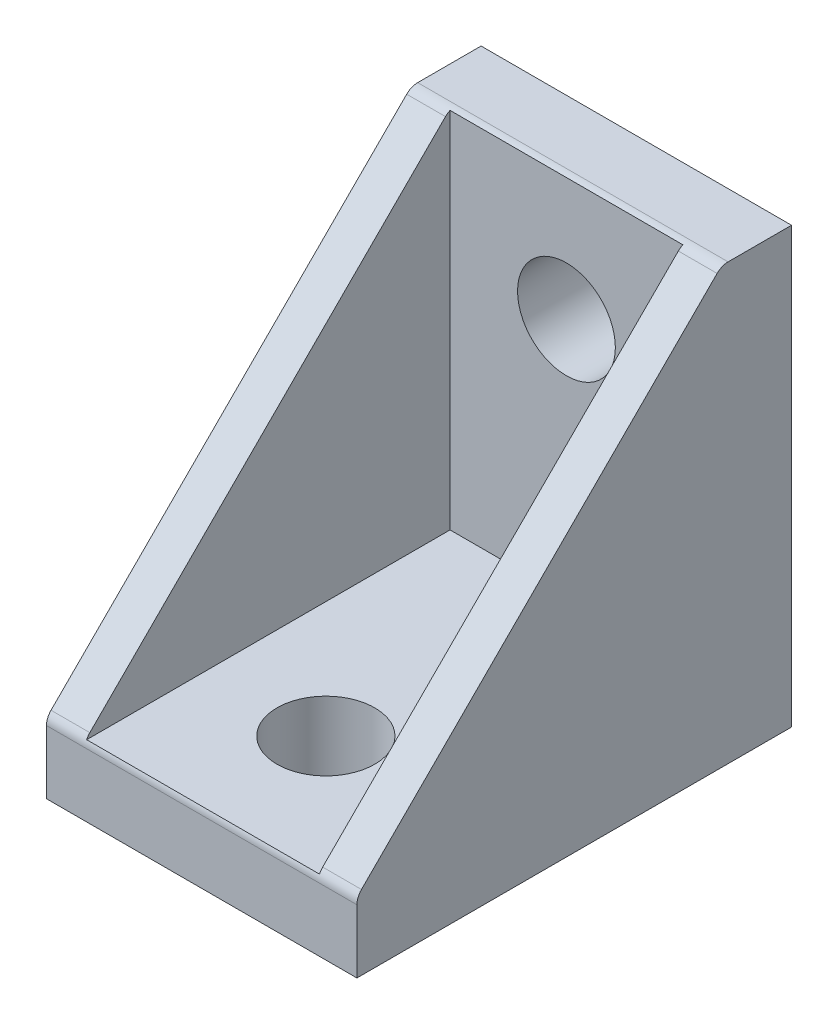
ISO-10303-21;
HEADER;
FILE_DESCRIPTION(('STEP AP214'),'2;1');
FILE_NAME('part.step','',(''),(''),'','','');
FILE_SCHEMA(('AUTOMOTIVE_DESIGN { 1 0 10303 214 1 1 1 1 }'));
ENDSEC;
DATA;
#1=APPLICATION_CONTEXT('core data for automotive mechanical design processes');
#2=APPLICATION_PROTOCOL_DEFINITION('international standard','automotive_design',2000,#1);
#3=PRODUCT_CONTEXT('',#1,'mechanical');
#4=PRODUCT('Part','Part','',(#3));
#5=PRODUCT_RELATED_PRODUCT_CATEGORY('part','',(#4));
#6=PRODUCT_DEFINITION_FORMATION('','',#4);
#7=PRODUCT_DEFINITION_CONTEXT('part definition',#1,'design');
#8=PRODUCT_DEFINITION('design','',#6,#7);
#9=PRODUCT_DEFINITION_SHAPE('','',#8);
#10=(LENGTH_UNIT() NAMED_UNIT(*) SI_UNIT(.MILLI.,.METRE.));
#11=(NAMED_UNIT(*) PLANE_ANGLE_UNIT() SI_UNIT($,.RADIAN.));
#12=(NAMED_UNIT(*) SI_UNIT($,.STERADIAN.) SOLID_ANGLE_UNIT());
#13=UNCERTAINTY_MEASURE_WITH_UNIT(LENGTH_MEASURE(1.E-05),#10,'distance_accuracy_value','');
#14=(GEOMETRIC_REPRESENTATION_CONTEXT(3) GLOBAL_UNCERTAINTY_ASSIGNED_CONTEXT((#13)) GLOBAL_UNIT_ASSIGNED_CONTEXT((#10,
#11,#12)) REPRESENTATION_CONTEXT('',''));
#15=CARTESIAN_POINT('',(0.,0.,0.));
#16=DIRECTION('',(0.,0.,1.));
#17=DIRECTION('',(1.,0.,0.));
#18=AXIS2_PLACEMENT_3D('',#15,#16,#17);
#19=CARTESIAN_POINT('',(10.,4.79289321881346,27.7071067811865));
#20=DIRECTION('',(0.,0.707106781186547,0.707106781186548));
#21=DIRECTION('',(0.,-0.707106781186548,0.707106781186547));
#22=AXIS2_PLACEMENT_3D('',#19,#20,#21);
#23=PLANE('',#22);
#24=CARTESIAN_POINT('',(-7.5,4.79289321881346,27.7071067811865));
#25=CARTESIAN_POINT('',(-7.5,12.4309644062712,20.0690355937288));
#26=CARTESIAN_POINT('',(-7.5,20.0690355937289,12.4309644062712));
#27=CARTESIAN_POINT('',(-7.5,27.7071067811866,4.79289321881346));
#28=B_SPLINE_CURVE_WITH_KNOTS('',3,(#24,#25,#26,#27),.UNSPECIFIED.,.F.,.F.,(4,4),(0.,1.),.UNSPECIFIED.);
#29=CARTESIAN_POINT('',(-7.5,4.79289321881346,27.7071067811865));
#30=VERTEX_POINT('',#29);
#31=CARTESIAN_POINT('',(-7.5,27.7071067811866,4.79289321881346));
#32=VERTEX_POINT('',#31);
#33=EDGE_CURVE('E207',#30,#32,#28,.T.);
#34=ORIENTED_EDGE('',*,*,#33,.T.);
#35=DIRECTION('',(-1.,0.,0.));
#36=VECTOR('',#35,1.);
#37=CARTESIAN_POINT('',(-10.,27.7071067811866,4.79289321881343));
#38=LINE('',#37,#36);
#39=CARTESIAN_POINT('',(-10.,27.7071067811866,4.79289321881346));
#40=VERTEX_POINT('',#39);
#41=EDGE_CURVE('E195',#32,#40,#38,.T.);
#42=ORIENTED_EDGE('',*,*,#41,.T.);
#43=CARTESIAN_POINT('',(-10.,4.79289321881346,27.7071067811865));
#44=CARTESIAN_POINT('',(-10.,12.4309644062712,20.0690355937288));
#45=CARTESIAN_POINT('',(-10.,20.0690355937289,12.4309644062712));
#46=CARTESIAN_POINT('',(-10.,27.7071067811866,4.79289321881346));
#47=B_SPLINE_CURVE_WITH_KNOTS('',3,(#43,#44,#45,#46),.UNSPECIFIED.,.F.,.F.,(4,4),(0.,1.),.UNSPECIFIED.);
#48=CARTESIAN_POINT('',(-10.,4.79289321881346,27.7071067811865));
#49=VERTEX_POINT('',#48);
#50=EDGE_CURVE('E221',#49,#40,#47,.T.);
#51=ORIENTED_EDGE('',*,*,#50,.F.);
#52=DIRECTION('',(-1.,0.,0.));
#53=VECTOR('',#52,1.);
#54=CARTESIAN_POINT('',(-7.5,4.79289321881342,27.7071067811866));
#55=LINE('',#54,#53);
#56=EDGE_CURVE('E193',#49,#30,#55,.F.);
#57=ORIENTED_EDGE('',*,*,#56,.T.);
#58=EDGE_LOOP('',(#34,#42,#51,#57));
#59=FACE_BOUND('',#58,.T.);
#60=ADVANCED_FACE('F33',(#59),#23,.T.);
#61=CARTESIAN_POINT('',(10.,4.79289321881346,27.7071067811865));
#62=CARTESIAN_POINT('',(10.,12.4309644062712,20.0690355937288));
#63=CARTESIAN_POINT('',(10.,20.0690355937289,12.4309644062712));
#64=CARTESIAN_POINT('',(10.,27.7071067811866,4.79289321881346));
#65=B_SPLINE_CURVE_WITH_KNOTS('',3,(#61,#62,#63,#64),.UNSPECIFIED.,.F.,.F.,(4,4),(0.,1.),.UNSPECIFIED.);
#66=CARTESIAN_POINT('',(10.,4.79289321881346,27.7071067811865));
#67=VERTEX_POINT('',#66);
#68=CARTESIAN_POINT('',(10.,27.7071067811866,4.79289321881346));
#69=VERTEX_POINT('',#68);
#70=EDGE_CURVE('E235',#67,#69,#65,.T.);
#71=ORIENTED_EDGE('',*,*,#70,.T.);
#72=DIRECTION('',(-1.,0.,0.));
#73=VECTOR('',#72,1.);
#74=CARTESIAN_POINT('',(7.5,27.7071067811866,4.79289321881343));
#75=LINE('',#74,#73);
#76=CARTESIAN_POINT('',(7.5,27.7071067811866,4.79289321881346));
#77=VERTEX_POINT('',#76);
#78=EDGE_CURVE('E228',#69,#77,#75,.T.);
#79=ORIENTED_EDGE('',*,*,#78,.T.);
#80=CARTESIAN_POINT('',(7.5,4.79289321881346,27.7071067811865));
#81=CARTESIAN_POINT('',(7.5,12.4309644062712,20.0690355937288));
#82=CARTESIAN_POINT('',(7.5,20.0690355937289,12.4309644062712));
#83=CARTESIAN_POINT('',(7.5,27.7071067811866,4.79289321881346));
#84=B_SPLINE_CURVE_WITH_KNOTS('',3,(#80,#81,#82,#83),.UNSPECIFIED.,.F.,.F.,(4,4),(0.,1.),.UNSPECIFIED.);
#85=CARTESIAN_POINT('',(7.5,4.79289321881346,27.7071067811865));
#86=VERTEX_POINT('',#85);
#87=EDGE_CURVE('E167',#86,#77,#84,.T.);
#88=ORIENTED_EDGE('',*,*,#87,.F.);
#89=DIRECTION('',(-1.,0.,0.));
#90=VECTOR('',#89,1.);
#91=CARTESIAN_POINT('',(10.,4.79289321881342,27.7071067811866));
#92=LINE('',#91,#90);
#93=EDGE_CURVE('E233',#86,#67,#92,.F.);
#94=ORIENTED_EDGE('',*,*,#93,.T.);
#95=EDGE_LOOP('',(#71,#79,#88,#94));
#96=FACE_BOUND('',#95,.T.);
#97=ADVANCED_FACE('F276',(#96),#23,.T.);
#98=CARTESIAN_POINT('',(10.,27.7071067811866,4.79289321881346));
#99=DIRECTION('',(1.,0.,0.));
#100=DIRECTION('',(0.,0.,-1.));
#101=AXIS2_PLACEMENT_3D('',#98,#99,#100);
#102=PLANE('',#101);
#103=DIRECTION('',(0.,0.,1.));
#104=VECTOR('',#103,1.);
#105=CARTESIAN_POINT('',(10.,28.,0.));
#106=LINE('',#105,#104);
#107=CARTESIAN_POINT('',(10.,28.,0.));
#108=VERTEX_POINT('',#107);
#109=CARTESIAN_POINT('',(10.,28.,4.08578643762696));
#110=VERTEX_POINT('',#109);
#111=EDGE_CURVE('E158',#108,#110,#106,.T.);
#112=ORIENTED_EDGE('',*,*,#111,.T.);
#113=CARTESIAN_POINT('',(10.,27.0000000000001,4.08578643762696));
#114=DIRECTION('',(1.,0.,0.));
#115=DIRECTION('',(0.,0.,-1.));
#116=AXIS2_PLACEMENT_3D('',#113,#114,#115);
#117=CIRCLE('',#116,0.999999999999891);
#118=EDGE_CURVE('E191',#110,#69,#117,.T.);
#119=ORIENTED_EDGE('',*,*,#118,.T.);
#120=ORIENTED_EDGE('',*,*,#70,.F.);
#121=CARTESIAN_POINT('',(10.,4.08578643762695,27.0000000000001));
#122=DIRECTION('',(1.,0.,0.));
#123=DIRECTION('',(0.,0.,-1.));
#124=AXIS2_PLACEMENT_3D('',#121,#122,#123);
#125=CIRCLE('',#124,0.999999999999891);
#126=CARTESIAN_POINT('',(10.,4.08578643762695,28.));
#127=VERTEX_POINT('',#126);
#128=EDGE_CURVE('E189',#67,#127,#125,.T.);
#129=ORIENTED_EDGE('',*,*,#128,.T.);
#130=DIRECTION('',(0.,1.,0.));
#131=VECTOR('',#130,1.);
#132=CARTESIAN_POINT('',(10.,0.,28.));
#133=LINE('',#132,#131);
#134=CARTESIAN_POINT('',(10.,0.,28.));
#135=VERTEX_POINT('',#134);
#136=EDGE_CURVE('E130',#135,#127,#133,.T.);
#137=ORIENTED_EDGE('',*,*,#136,.F.);
#138=DIRECTION('',(0.,0.,1.));
#139=VECTOR('',#138,1.);
#140=CARTESIAN_POINT('',(10.,0.,28.));
#141=LINE('',#140,#139);
#142=CARTESIAN_POINT('',(10.,0.,0.));
#143=VERTEX_POINT('',#142);
#144=EDGE_CURVE('E123',#143,#135,#141,.T.);
#145=ORIENTED_EDGE('',*,*,#144,.F.);
#146=DIRECTION('',(0.,-1.,0.));
#147=VECTOR('',#146,1.);
#148=CARTESIAN_POINT('',(10.,0.,0.));
#149=LINE('',#148,#147);
#150=EDGE_CURVE('E128',#108,#143,#149,.T.);
#151=ORIENTED_EDGE('',*,*,#150,.F.);
#152=EDGE_LOOP('',(#112,#119,#120,#129,#137,#145,#151));
#153=FACE_BOUND('',#152,.T.);
#154=ADVANCED_FACE('F126',(#153),#102,.T.);
#155=CARTESIAN_POINT('',(-10.,27.7071067811866,4.79289321881346));
#156=DIRECTION('',(1.,0.,0.));
#157=DIRECTION('',(0.,0.,-1.));
#158=AXIS2_PLACEMENT_3D('',#155,#156,#157);
#159=PLANE('',#158);
#160=ORIENTED_EDGE('',*,*,#50,.T.);
#161=CARTESIAN_POINT('',(-10.,27.0000000000001,4.08578643762696));
#162=DIRECTION('',(1.,0.,0.));
#163=DIRECTION('',(0.,0.,-1.));
#164=AXIS2_PLACEMENT_3D('',#161,#162,#163);
#165=CIRCLE('',#164,0.999999999999891);
#166=CARTESIAN_POINT('',(-10.,28.,4.08578643762696));
#167=VERTEX_POINT('',#166);
#168=EDGE_CURVE('E199',#40,#167,#165,.F.);
#169=ORIENTED_EDGE('',*,*,#168,.T.);
#170=DIRECTION('',(0.,0.,1.));
#171=VECTOR('',#170,1.);
#172=CARTESIAN_POINT('',(-10.,28.,0.));
#173=LINE('',#172,#171);
#174=CARTESIAN_POINT('',(-10.,28.,0.));
#175=VERTEX_POINT('',#174);
#176=EDGE_CURVE('E160',#175,#167,#173,.T.);
#177=ORIENTED_EDGE('',*,*,#176,.F.);
#178=DIRECTION('',(0.,1.,0.));
#179=VECTOR('',#178,1.);
#180=CARTESIAN_POINT('',(-10.,28.,0.));
#181=LINE('',#180,#179);
#182=CARTESIAN_POINT('',(-10.,0.,0.));
#183=VERTEX_POINT('',#182);
#184=EDGE_CURVE('E143',#183,#175,#181,.T.);
#185=ORIENTED_EDGE('',*,*,#184,.F.);
#186=DIRECTION('',(0.,0.,-1.));
#187=VECTOR('',#186,1.);
#188=CARTESIAN_POINT('',(-10.,0.,4.5));
#189=LINE('',#188,#187);
#190=CARTESIAN_POINT('',(-10.,0.,28.));
#191=VERTEX_POINT('',#190);
#192=EDGE_CURVE('E140',#191,#183,#189,.T.);
#193=ORIENTED_EDGE('',*,*,#192,.F.);
#194=DIRECTION('',(0.,1.,0.));
#195=VECTOR('',#194,1.);
#196=CARTESIAN_POINT('',(-10.,0.,28.));
#197=LINE('',#196,#195);
#198=CARTESIAN_POINT('',(-10.,4.08578643762695,28.));
#199=VERTEX_POINT('',#198);
#200=EDGE_CURVE('E254',#191,#199,#197,.T.);
#201=ORIENTED_EDGE('',*,*,#200,.T.);
#202=CARTESIAN_POINT('',(-10.,4.08578643762695,27.0000000000001));
#203=DIRECTION('',(1.,0.,0.));
#204=DIRECTION('',(0.,0.,-1.));
#205=AXIS2_PLACEMENT_3D('',#202,#203,#204);
#206=CIRCLE('',#205,0.999999999999891);
#207=EDGE_CURVE('E197',#199,#49,#206,.F.);
#208=ORIENTED_EDGE('',*,*,#207,.T.);
#209=EDGE_LOOP('',(#160,#169,#177,#185,#193,#201,#208));
#210=FACE_BOUND('',#209,.T.);
#211=ADVANCED_FACE('F220',(#210),#159,.F.);
#212=CARTESIAN_POINT('',(-10.,0.,28.));
#213=DIRECTION('',(0.,0.,-1.));
#214=DIRECTION('',(-1.,0.,0.));
#215=AXIS2_PLACEMENT_3D('',#212,#213,#214);
#216=PLANE('',#215);
#217=ORIENTED_EDGE('',*,*,#136,.T.);
#218=DIRECTION('',(-1.,0.,0.));
#219=VECTOR('',#218,1.);
#220=CARTESIAN_POINT('',(-10.,4.08578643762695,28.));
#221=LINE('',#220,#219);
#222=EDGE_CURVE('E41',#127,#199,#221,.T.);
#223=ORIENTED_EDGE('',*,*,#222,.T.);
#224=ORIENTED_EDGE('',*,*,#200,.F.);
#225=DIRECTION('',(-1.,0.,0.));
#226=VECTOR('',#225,1.);
#227=CARTESIAN_POINT('',(-10.,0.,28.));
#228=LINE('',#227,#226);
#229=EDGE_CURVE('E133',#135,#191,#228,.T.);
#230=ORIENTED_EDGE('',*,*,#229,.F.);
#231=EDGE_LOOP('',(#217,#223,#224,#230));
#232=FACE_BOUND('',#231,.T.);
#233=ADVANCED_FACE('F280',(#232),#216,.F.);
#234=CARTESIAN_POINT('',(0.,0.,0.));
#235=DIRECTION('',(0.,1.,0.));
#236=DIRECTION('',(0.,0.,1.));
#237=AXIS2_PLACEMENT_3D('',#234,#235,#236);
#238=PLANE('',#237);
#239=CARTESIAN_POINT('',(0.,0.,20.));
#240=DIRECTION('',(0.,1.,0.));
#241=DIRECTION('',(0.,0.,1.));
#242=AXIS2_PLACEMENT_3D('',#239,#240,#241);
#243=CIRCLE('',#242,3.15);
#244=CARTESIAN_POINT('',(0.,0.,23.15));
#245=VERTEX_POINT('',#244);
#246=EDGE_CURVE('E332',#245,#245,#243,.T.);
#247=ORIENTED_EDGE('',*,*,#246,.T.);
#248=EDGE_LOOP('',(#247));
#249=FACE_BOUND('',#248,.T.);
#250=ORIENTED_EDGE('',*,*,#192,.T.);
#251=DIRECTION('',(-1.,0.,0.));
#252=VECTOR('',#251,1.);
#253=CARTESIAN_POINT('',(-10.,0.,0.));
#254=LINE('',#253,#252);
#255=EDGE_CURVE('E137',#143,#183,#254,.T.);
#256=ORIENTED_EDGE('',*,*,#255,.F.);
#257=ORIENTED_EDGE('',*,*,#144,.T.);
#258=ORIENTED_EDGE('',*,*,#229,.T.);
#259=EDGE_LOOP('',(#250,#256,#257,#258));
#260=FACE_BOUND('',#259,.T.);
#261=ADVANCED_FACE('F138',(#249,#260),#238,.F.);
#262=CARTESIAN_POINT('',(7.5,4.5,4.5));
#263=DIRECTION('',(0.,-1.,0.));
#264=DIRECTION('',(0.,0.,-1.));
#265=AXIS2_PLACEMENT_3D('',#262,#263,#264);
#266=PLANE('',#265);
#267=CARTESIAN_POINT('',(0.,4.5,20.));
#268=DIRECTION('',(0.,1.,0.));
#269=DIRECTION('',(0.,0.,1.));
#270=AXIS2_PLACEMENT_3D('',#267,#268,#269);
#271=CIRCLE('',#270,3.14999999999999);
#272=CARTESIAN_POINT('',(0.,4.5,23.15));
#273=VERTEX_POINT('',#272);
#274=EDGE_CURVE('E331',#273,#273,#271,.T.);
#275=ORIENTED_EDGE('',*,*,#274,.F.);
#276=EDGE_LOOP('',(#275));
#277=FACE_BOUND('',#276,.T.);
#278=DIRECTION('',(1.,0.,0.));
#279=VECTOR('',#278,1.);
#280=CARTESIAN_POINT('',(-7.5,4.5,27.9101797211245));
#281=LINE('',#280,#279);
#282=CARTESIAN_POINT('',(-7.5,4.5,27.9101797211245));
#283=VERTEX_POINT('',#282);
#284=CARTESIAN_POINT('',(7.5,4.5,27.9101797211245));
#285=VERTEX_POINT('',#284);
#286=EDGE_CURVE('E11',#283,#285,#281,.T.);
#287=ORIENTED_EDGE('',*,*,#286,.T.);
#288=DIRECTION('',(0.,0.,1.));
#289=VECTOR('',#288,1.);
#290=CARTESIAN_POINT('',(7.5,4.5,4.5));
#291=LINE('',#290,#289);
#292=CARTESIAN_POINT('',(7.5,4.5,4.5));
#293=VERTEX_POINT('',#292);
#294=EDGE_CURVE('E164',#293,#285,#291,.T.);
#295=ORIENTED_EDGE('',*,*,#294,.F.);
#296=DIRECTION('',(-1.,0.,0.));
#297=VECTOR('',#296,1.);
#298=CARTESIAN_POINT('',(7.5,4.5,4.5));
#299=LINE('',#298,#297);
#300=CARTESIAN_POINT('',(-7.5,4.5,4.5));
#301=VERTEX_POINT('',#300);
#302=EDGE_CURVE('E134',#293,#301,#299,.T.);
#303=ORIENTED_EDGE('',*,*,#302,.T.);
#304=DIRECTION('',(0.,0.,1.));
#305=VECTOR('',#304,1.);
#306=CARTESIAN_POINT('',(-7.5,4.5,4.5));
#307=LINE('',#306,#305);
#308=EDGE_CURVE('E178',#301,#283,#307,.T.);
#309=ORIENTED_EDGE('',*,*,#308,.T.);
#310=EDGE_LOOP('',(#287,#295,#303,#309));
#311=FACE_BOUND('',#310,.T.);
#312=ADVANCED_FACE('F267',(#277,#311),#266,.F.);
#313=CARTESIAN_POINT('',(7.5,28.,4.5));
#314=DIRECTION('',(1.,0.,0.));
#315=DIRECTION('',(0.,0.,-1.));
#316=AXIS2_PLACEMENT_3D('',#313,#314,#315);
#317=PLANE('',#316);
#318=ORIENTED_EDGE('',*,*,#87,.T.);
#319=CARTESIAN_POINT('',(7.5,27.0000000000001,4.08578643762696));
#320=DIRECTION('',(1.,0.,0.));
#321=DIRECTION('',(0.,0.,-1.));
#322=AXIS2_PLACEMENT_3D('',#319,#320,#321);
#323=CIRCLE('',#322,0.999999999999891);
#324=CARTESIAN_POINT('',(7.5,27.9101797211245,4.5));
#325=VERTEX_POINT('',#324);
#326=EDGE_CURVE('E183',#77,#325,#323,.F.);
#327=ORIENTED_EDGE('',*,*,#326,.T.);
#328=DIRECTION('',(0.,-1.,0.));
#329=VECTOR('',#328,1.);
#330=CARTESIAN_POINT('',(7.5,28.,4.5));
#331=LINE('',#330,#329);
#332=EDGE_CURVE('E168',#325,#293,#331,.T.);
#333=ORIENTED_EDGE('',*,*,#332,.T.);
#334=ORIENTED_EDGE('',*,*,#294,.T.);
#335=CARTESIAN_POINT('',(7.5,4.08578643762695,27.0000000000001));
#336=DIRECTION('',(1.,0.,0.));
#337=DIRECTION('',(0.,0.,-1.));
#338=AXIS2_PLACEMENT_3D('',#335,#336,#337);
#339=CIRCLE('',#338,0.999999999999891);
#340=EDGE_CURVE('E232',#285,#86,#339,.F.);
#341=ORIENTED_EDGE('',*,*,#340,.T.);
#342=EDGE_LOOP('',(#318,#327,#333,#334,#341));
#343=FACE_BOUND('',#342,.T.);
#344=ADVANCED_FACE('F273',(#343),#317,.F.);
#345=CARTESIAN_POINT('',(-7.5,28.,4.5));
#346=DIRECTION('',(1.,0.,0.));
#347=DIRECTION('',(0.,0.,-1.));
#348=AXIS2_PLACEMENT_3D('',#345,#346,#347);
#349=PLANE('',#348);
#350=DIRECTION('',(0.,-1.,0.));
#351=VECTOR('',#350,1.);
#352=CARTESIAN_POINT('',(-7.5,28.,4.5));
#353=LINE('',#352,#351);
#354=CARTESIAN_POINT('',(-7.5,27.9101797211245,4.5));
#355=VERTEX_POINT('',#354);
#356=EDGE_CURVE('E163',#355,#301,#353,.T.);
#357=ORIENTED_EDGE('',*,*,#356,.F.);
#358=CARTESIAN_POINT('',(-7.5,27.0000000000001,4.08578643762696));
#359=DIRECTION('',(1.,0.,0.));
#360=DIRECTION('',(0.,0.,-1.));
#361=AXIS2_PLACEMENT_3D('',#358,#359,#360);
#362=CIRCLE('',#361,0.999999999999891);
#363=EDGE_CURVE('E202',#355,#32,#362,.T.);
#364=ORIENTED_EDGE('',*,*,#363,.T.);
#365=ORIENTED_EDGE('',*,*,#33,.F.);
#366=CARTESIAN_POINT('',(-7.5,4.08578643762695,27.0000000000001));
#367=DIRECTION('',(1.,0.,0.));
#368=DIRECTION('',(0.,0.,-1.));
#369=AXIS2_PLACEMENT_3D('',#366,#367,#368);
#370=CIRCLE('',#369,0.999999999999891);
#371=EDGE_CURVE('E48',#30,#283,#370,.T.);
#372=ORIENTED_EDGE('',*,*,#371,.T.);
#373=ORIENTED_EDGE('',*,*,#308,.F.);
#374=EDGE_LOOP('',(#357,#364,#365,#372,#373));
#375=FACE_BOUND('',#374,.T.);
#376=ADVANCED_FACE('F206',(#375),#349,.T.);
#377=CARTESIAN_POINT('',(0.,0.,4.5));
#378=DIRECTION('',(0.,0.,1.));
#379=DIRECTION('',(1.,0.,0.));
#380=AXIS2_PLACEMENT_3D('',#377,#378,#379);
#381=PLANE('',#380);
#382=CARTESIAN_POINT('',(0.,20.,4.5));
#383=DIRECTION('',(0.,0.,1.));
#384=DIRECTION('',(1.,0.,0.));
#385=AXIS2_PLACEMENT_3D('',#382,#383,#384);
#386=CIRCLE('',#385,3.14999999999999);
#387=CARTESIAN_POINT('',(3.14999999999999,20.,4.5));
#388=VERTEX_POINT('',#387);
#389=EDGE_CURVE('E149',#388,#388,#386,.T.);
#390=ORIENTED_EDGE('',*,*,#389,.F.);
#391=EDGE_LOOP('',(#390));
#392=FACE_BOUND('',#391,.T.);
#393=ORIENTED_EDGE('',*,*,#332,.F.);
#394=DIRECTION('',(1.,0.,0.));
#395=VECTOR('',#394,1.);
#396=CARTESIAN_POINT('',(7.5,27.9101797211245,4.5));
#397=LINE('',#396,#395);
#398=EDGE_CURVE('E185',#325,#355,#397,.F.);
#399=ORIENTED_EDGE('',*,*,#398,.T.);
#400=ORIENTED_EDGE('',*,*,#356,.T.);
#401=ORIENTED_EDGE('',*,*,#302,.F.);
#402=EDGE_LOOP('',(#393,#399,#400,#401));
#403=FACE_BOUND('',#402,.T.);
#404=ADVANCED_FACE('F271',(#392,#403),#381,.T.);
#405=CARTESIAN_POINT('',(10.,28.,0.));
#406=DIRECTION('',(0.,-1.,0.));
#407=DIRECTION('',(0.,0.,-1.));
#408=AXIS2_PLACEMENT_3D('',#405,#406,#407);
#409=PLANE('',#408);
#410=DIRECTION('',(-1.,0.,0.));
#411=VECTOR('',#410,1.);
#412=CARTESIAN_POINT('',(-7.5,28.,4.08578643762696));
#413=LINE('',#412,#411);
#414=EDGE_CURVE('E187',#167,#110,#413,.F.);
#415=ORIENTED_EDGE('',*,*,#414,.T.);
#416=ORIENTED_EDGE('',*,*,#111,.F.);
#417=DIRECTION('',(1.,0.,0.));
#418=VECTOR('',#417,1.);
#419=CARTESIAN_POINT('',(10.,28.,0.));
#420=LINE('',#419,#418);
#421=EDGE_CURVE('E147',#175,#108,#420,.T.);
#422=ORIENTED_EDGE('',*,*,#421,.F.);
#423=ORIENTED_EDGE('',*,*,#176,.T.);
#424=EDGE_LOOP('',(#415,#416,#422,#423));
#425=FACE_BOUND('',#424,.T.);
#426=ADVANCED_FACE('F223',(#425),#409,.F.);
#427=CARTESIAN_POINT('',(0.,0.,0.));
#428=DIRECTION('',(0.,0.,1.));
#429=DIRECTION('',(1.,0.,0.));
#430=AXIS2_PLACEMENT_3D('',#427,#428,#429);
#431=PLANE('',#430);
#432=CARTESIAN_POINT('',(0.,20.,0.));
#433=DIRECTION('',(0.,0.,-1.));
#434=DIRECTION('',(-1.,0.,0.));
#435=AXIS2_PLACEMENT_3D('',#432,#433,#434);
#436=CIRCLE('',#435,3.14999999999999);
#437=CARTESIAN_POINT('',(-3.14999999999999,20.,0.));
#438=VERTEX_POINT('',#437);
#439=EDGE_CURVE('E152',#438,#438,#436,.T.);
#440=ORIENTED_EDGE('',*,*,#439,.F.);
#441=EDGE_LOOP('',(#440));
#442=FACE_BOUND('',#441,.T.);
#443=ORIENTED_EDGE('',*,*,#150,.T.);
#444=ORIENTED_EDGE('',*,*,#255,.T.);
#445=ORIENTED_EDGE('',*,*,#184,.T.);
#446=ORIENTED_EDGE('',*,*,#421,.T.);
#447=EDGE_LOOP('',(#443,#444,#445,#446));
#448=FACE_BOUND('',#447,.T.);
#449=ADVANCED_FACE('F145',(#442,#448),#431,.F.);
#450=CARTESIAN_POINT('',(0.,20.,0.));
#451=DIRECTION('',(0.,0.,-1.));
#452=DIRECTION('',(-1.,0.,0.));
#453=AXIS2_PLACEMENT_3D('',#450,#451,#452);
#454=CYLINDRICAL_SURFACE('',#453,3.14999999999999);
#455=ORIENTED_EDGE('',*,*,#389,.T.);
#456=EDGE_LOOP('',(#455));
#457=FACE_BOUND('',#456,.T.);
#458=ORIENTED_EDGE('',*,*,#439,.T.);
#459=EDGE_LOOP('',(#458));
#460=FACE_BOUND('',#459,.T.);
#461=ADVANCED_FACE('F302',(#457,#460),#454,.F.);
#462=CARTESIAN_POINT('',(0.,4.5,20.));
#463=DIRECTION('',(0.,1.,0.));
#464=DIRECTION('',(0.,0.,1.));
#465=AXIS2_PLACEMENT_3D('',#462,#463,#464);
#466=CYLINDRICAL_SURFACE('',#465,3.14999999999999);
#467=ORIENTED_EDGE('',*,*,#246,.F.);
#468=EDGE_LOOP('',(#467));
#469=FACE_BOUND('',#468,.T.);
#470=ORIENTED_EDGE('',*,*,#274,.T.);
#471=EDGE_LOOP('',(#470));
#472=FACE_BOUND('',#471,.T.);
#473=ADVANCED_FACE('F297',(#469,#472),#466,.F.);
#474=CARTESIAN_POINT('',(10.,27.0000000000001,4.08578643762696));
#475=DIRECTION('',(1.,0.,0.));
#476=DIRECTION('',(0.,0.,-1.));
#477=AXIS2_PLACEMENT_3D('',#474,#475,#476);
#478=CYLINDRICAL_SURFACE('',#477,0.999999999999891);
#479=ORIENTED_EDGE('',*,*,#363,.F.);
#480=ORIENTED_EDGE('',*,*,#398,.F.);
#481=ORIENTED_EDGE('',*,*,#326,.F.);
#482=ORIENTED_EDGE('',*,*,#78,.F.);
#483=ORIENTED_EDGE('',*,*,#118,.F.);
#484=ORIENTED_EDGE('',*,*,#414,.F.);
#485=ORIENTED_EDGE('',*,*,#168,.F.);
#486=ORIENTED_EDGE('',*,*,#41,.F.);
#487=EDGE_LOOP('',(#479,#480,#481,#482,#483,#484,#485,#486));
#488=FACE_BOUND('',#487,.T.);
#489=ADVANCED_FACE('F215',(#488),#478,.T.);
#490=CARTESIAN_POINT('',(-10.,4.08578643762695,27.0000000000001));
#491=DIRECTION('',(1.,0.,0.));
#492=DIRECTION('',(0.,0.,-1.));
#493=AXIS2_PLACEMENT_3D('',#490,#491,#492);
#494=CYLINDRICAL_SURFACE('',#493,0.999999999999891);
#495=ORIENTED_EDGE('',*,*,#207,.F.);
#496=ORIENTED_EDGE('',*,*,#222,.F.);
#497=ORIENTED_EDGE('',*,*,#128,.F.);
#498=ORIENTED_EDGE('',*,*,#93,.F.);
#499=ORIENTED_EDGE('',*,*,#340,.F.);
#500=ORIENTED_EDGE('',*,*,#286,.F.);
#501=ORIENTED_EDGE('',*,*,#371,.F.);
#502=ORIENTED_EDGE('',*,*,#56,.F.);
#503=EDGE_LOOP('',(#495,#496,#497,#498,#499,#500,#501,#502));
#504=FACE_BOUND('',#503,.T.);
#505=ADVANCED_FACE('F35',(#504),#494,.T.);
#506=CLOSED_SHELL('',(#60,#97,#154,#211,#233,#261,#312,#344,#376,#404,#426,#449,#461,#473,#489,#505));
#507=MANIFOLD_SOLID_BREP('B2',#506);
#508=ADVANCED_BREP_SHAPE_REPRESENTATION('',(#18,#507),#14);
#509=SHAPE_DEFINITION_REPRESENTATION(#9,#508);
ENDSEC;
END-ISO-10303-21;
